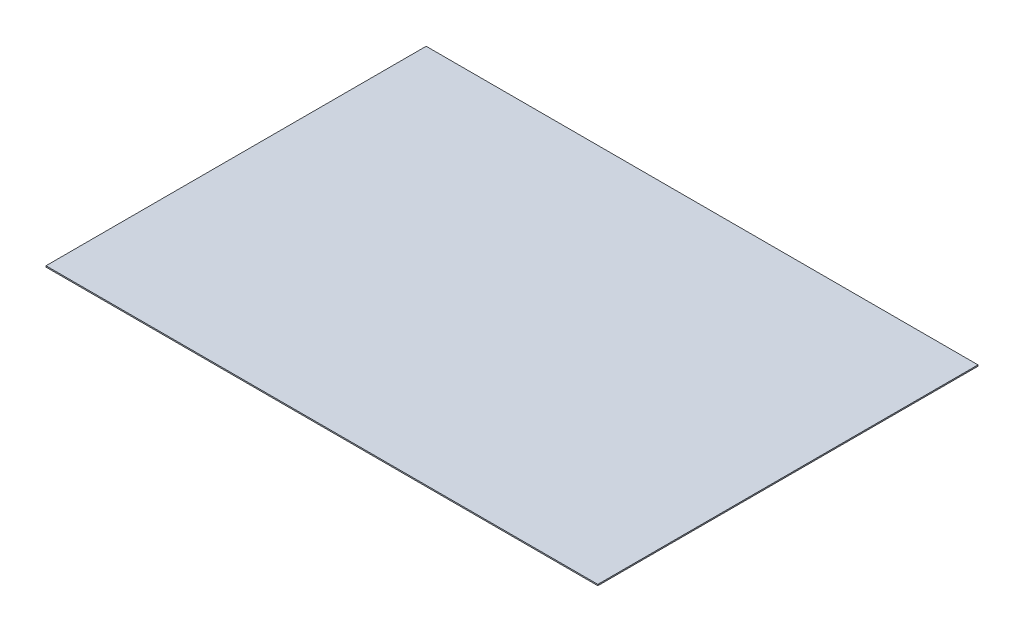
ISO-10303-21;
HEADER;
FILE_DESCRIPTION(('STEP AP214'),'2;1');
FILE_NAME('part.step','',(''),(''),'','','');
FILE_SCHEMA(('AUTOMOTIVE_DESIGN { 1 0 10303 214 1 1 1 1 }'));
ENDSEC;
DATA;
#1=APPLICATION_CONTEXT('core data for automotive mechanical design processes');
#2=APPLICATION_PROTOCOL_DEFINITION('international standard','automotive_design',2000,#1);
#3=PRODUCT_CONTEXT('',#1,'mechanical');
#4=PRODUCT('Part','Part','',(#3));
#5=PRODUCT_RELATED_PRODUCT_CATEGORY('part','',(#4));
#6=PRODUCT_DEFINITION_FORMATION('','',#4);
#7=PRODUCT_DEFINITION_CONTEXT('part definition',#1,'design');
#8=PRODUCT_DEFINITION('design','',#6,#7);
#9=PRODUCT_DEFINITION_SHAPE('','',#8);
#10=(LENGTH_UNIT() NAMED_UNIT(*) SI_UNIT(.MILLI.,.METRE.));
#11=(NAMED_UNIT(*) PLANE_ANGLE_UNIT() SI_UNIT($,.RADIAN.));
#12=(NAMED_UNIT(*) SI_UNIT($,.STERADIAN.) SOLID_ANGLE_UNIT());
#13=UNCERTAINTY_MEASURE_WITH_UNIT(LENGTH_MEASURE(1.E-05),#10,'distance_accuracy_value','');
#14=(GEOMETRIC_REPRESENTATION_CONTEXT(3) GLOBAL_UNCERTAINTY_ASSIGNED_CONTEXT((#13)) GLOBAL_UNIT_ASSIGNED_CONTEXT((#10,
#11,#12)) REPRESENTATION_CONTEXT('',''));
#15=CARTESIAN_POINT('',(0.,0.,0.));
#16=DIRECTION('',(0.,0.,1.));
#17=DIRECTION('',(1.,0.,0.));
#18=AXIS2_PLACEMENT_3D('',#15,#16,#17);
#19=CARTESIAN_POINT('',(225.,1.,-155.));
#20=DIRECTION('',(-1.,0.,0.));
#21=DIRECTION('',(0.,0.,1.));
#22=AXIS2_PLACEMENT_3D('',#19,#20,#21);
#23=PLANE('',#22);
#24=DIRECTION('',(0.,0.,-1.));
#25=VECTOR('',#24,1.);
#26=CARTESIAN_POINT('',(225.,0.,-155.));
#27=LINE('',#26,#25);
#28=CARTESIAN_POINT('',(225.,0.,155.));
#29=VERTEX_POINT('',#28);
#30=CARTESIAN_POINT('',(225.,0.,-155.));
#31=VERTEX_POINT('',#30);
#32=EDGE_CURVE('E96',#29,#31,#27,.T.);
#33=ORIENTED_EDGE('',*,*,#32,.T.);
#34=DIRECTION('',(0.,-1.,0.));
#35=VECTOR('',#34,1.);
#36=CARTESIAN_POINT('',(225.,1.,-155.));
#37=LINE('',#36,#35);
#38=CARTESIAN_POINT('',(225.,1.,-155.));
#39=VERTEX_POINT('',#38);
#40=EDGE_CURVE('E11',#39,#31,#37,.T.);
#41=ORIENTED_EDGE('',*,*,#40,.F.);
#42=DIRECTION('',(0.,0.,-1.));
#43=VECTOR('',#42,1.);
#44=CARTESIAN_POINT('',(225.,1.,-155.));
#45=LINE('',#44,#43);
#46=CARTESIAN_POINT('',(225.,1.,155.));
#47=VERTEX_POINT('',#46);
#48=EDGE_CURVE('E84',#47,#39,#45,.T.);
#49=ORIENTED_EDGE('',*,*,#48,.F.);
#50=DIRECTION('',(0.,-1.,0.));
#51=VECTOR('',#50,1.);
#52=CARTESIAN_POINT('',(225.,1.,155.));
#53=LINE('',#52,#51);
#54=EDGE_CURVE('E92',#47,#29,#53,.T.);
#55=ORIENTED_EDGE('',*,*,#54,.T.);
#56=EDGE_LOOP('',(#33,#41,#49,#55));
#57=FACE_BOUND('',#56,.T.);
#58=ADVANCED_FACE('F33',(#57),#23,.F.);
#59=CARTESIAN_POINT('',(-225.,1.,-155.));
#60=DIRECTION('',(0.,0.,1.));
#61=DIRECTION('',(1.,0.,0.));
#62=AXIS2_PLACEMENT_3D('',#59,#60,#61);
#63=PLANE('',#62);
#64=DIRECTION('',(-1.,0.,0.));
#65=VECTOR('',#64,1.);
#66=CARTESIAN_POINT('',(-225.,0.,-155.));
#67=LINE('',#66,#65);
#68=CARTESIAN_POINT('',(-225.,0.,-155.));
#69=VERTEX_POINT('',#68);
#70=EDGE_CURVE('E88',#31,#69,#67,.T.);
#71=ORIENTED_EDGE('',*,*,#70,.T.);
#72=DIRECTION('',(0.,-1.,0.));
#73=VECTOR('',#72,1.);
#74=CARTESIAN_POINT('',(-225.,1.,-155.));
#75=LINE('',#74,#73);
#76=CARTESIAN_POINT('',(-225.,1.,-155.));
#77=VERTEX_POINT('',#76);
#78=EDGE_CURVE('E41',#77,#69,#75,.T.);
#79=ORIENTED_EDGE('',*,*,#78,.F.);
#80=DIRECTION('',(-1.,0.,0.));
#81=VECTOR('',#80,1.);
#82=CARTESIAN_POINT('',(-225.,1.,-155.));
#83=LINE('',#82,#81);
#84=EDGE_CURVE('E79',#39,#77,#83,.T.);
#85=ORIENTED_EDGE('',*,*,#84,.F.);
#86=ORIENTED_EDGE('',*,*,#40,.T.);
#87=EDGE_LOOP('',(#71,#79,#85,#86));
#88=FACE_BOUND('',#87,.T.);
#89=ADVANCED_FACE('F87',(#88),#63,.F.);
#90=CARTESIAN_POINT('',(-225.,1.,-155.));
#91=DIRECTION('',(1.,0.,0.));
#92=DIRECTION('',(0.,0.,-1.));
#93=AXIS2_PLACEMENT_3D('',#90,#91,#92);
#94=PLANE('',#93);
#95=DIRECTION('',(0.,0.,1.));
#96=VECTOR('',#95,1.);
#97=CARTESIAN_POINT('',(-225.,0.,-155.));
#98=LINE('',#97,#96);
#99=CARTESIAN_POINT('',(-225.,0.,155.));
#100=VERTEX_POINT('',#99);
#101=EDGE_CURVE('E66',#69,#100,#98,.T.);
#102=ORIENTED_EDGE('',*,*,#101,.T.);
#103=DIRECTION('',(0.,-1.,0.));
#104=VECTOR('',#103,1.);
#105=CARTESIAN_POINT('',(-225.,1.,155.));
#106=LINE('',#105,#104);
#107=CARTESIAN_POINT('',(-225.,1.,155.));
#108=VERTEX_POINT('',#107);
#109=EDGE_CURVE('E89',#108,#100,#106,.T.);
#110=ORIENTED_EDGE('',*,*,#109,.F.);
#111=DIRECTION('',(0.,0.,1.));
#112=VECTOR('',#111,1.);
#113=CARTESIAN_POINT('',(-225.,1.,-155.));
#114=LINE('',#113,#112);
#115=EDGE_CURVE('E82',#77,#108,#114,.T.);
#116=ORIENTED_EDGE('',*,*,#115,.F.);
#117=ORIENTED_EDGE('',*,*,#78,.T.);
#118=EDGE_LOOP('',(#102,#110,#116,#117));
#119=FACE_BOUND('',#118,.T.);
#120=ADVANCED_FACE('F90',(#119),#94,.F.);
#121=CARTESIAN_POINT('',(-225.,1.,155.));
#122=DIRECTION('',(0.,0.,-1.));
#123=DIRECTION('',(-1.,0.,0.));
#124=AXIS2_PLACEMENT_3D('',#121,#122,#123);
#125=PLANE('',#124);
#126=DIRECTION('',(1.,0.,0.));
#127=VECTOR('',#126,1.);
#128=CARTESIAN_POINT('',(-225.,0.,155.));
#129=LINE('',#128,#127);
#130=EDGE_CURVE('E72',#100,#29,#129,.T.);
#131=ORIENTED_EDGE('',*,*,#130,.T.);
#132=ORIENTED_EDGE('',*,*,#54,.F.);
#133=DIRECTION('',(1.,0.,0.));
#134=VECTOR('',#133,1.);
#135=CARTESIAN_POINT('',(-225.,1.,155.));
#136=LINE('',#135,#134);
#137=EDGE_CURVE('E49',#108,#47,#136,.T.);
#138=ORIENTED_EDGE('',*,*,#137,.F.);
#139=ORIENTED_EDGE('',*,*,#109,.T.);
#140=EDGE_LOOP('',(#131,#132,#138,#139));
#141=FACE_BOUND('',#140,.T.);
#142=ADVANCED_FACE('F103',(#141),#125,.F.);
#143=CARTESIAN_POINT('',(0.,1.,0.));
#144=DIRECTION('',(0.,1.,0.));
#145=DIRECTION('',(0.,0.,1.));
#146=AXIS2_PLACEMENT_3D('',#143,#144,#145);
#147=PLANE('',#146);
#148=ORIENTED_EDGE('',*,*,#48,.T.);
#149=ORIENTED_EDGE('',*,*,#84,.T.);
#150=ORIENTED_EDGE('',*,*,#115,.T.);
#151=ORIENTED_EDGE('',*,*,#137,.T.);
#152=EDGE_LOOP('',(#148,#149,#150,#151));
#153=FACE_BOUND('',#152,.T.);
#154=ADVANCED_FACE('F80',(#153),#147,.T.);
#155=CARTESIAN_POINT('',(0.,0.,0.));
#156=DIRECTION('',(0.,1.,0.));
#157=DIRECTION('',(0.,0.,1.));
#158=AXIS2_PLACEMENT_3D('',#155,#156,#157);
#159=PLANE('',#158);
#160=ORIENTED_EDGE('',*,*,#32,.F.);
#161=ORIENTED_EDGE('',*,*,#130,.F.);
#162=ORIENTED_EDGE('',*,*,#101,.F.);
#163=ORIENTED_EDGE('',*,*,#70,.F.);
#164=EDGE_LOOP('',(#160,#161,#162,#163));
#165=FACE_BOUND('',#164,.T.);
#166=ADVANCED_FACE('F106',(#165),#159,.F.);
#167=CLOSED_SHELL('',(#58,#89,#120,#142,#154,#166));
#168=MANIFOLD_SOLID_BREP('B2',#167);
#169=ADVANCED_BREP_SHAPE_REPRESENTATION('',(#18,#168),#14);
#170=SHAPE_DEFINITION_REPRESENTATION(#9,#169);
ENDSEC;
END-ISO-10303-21;
